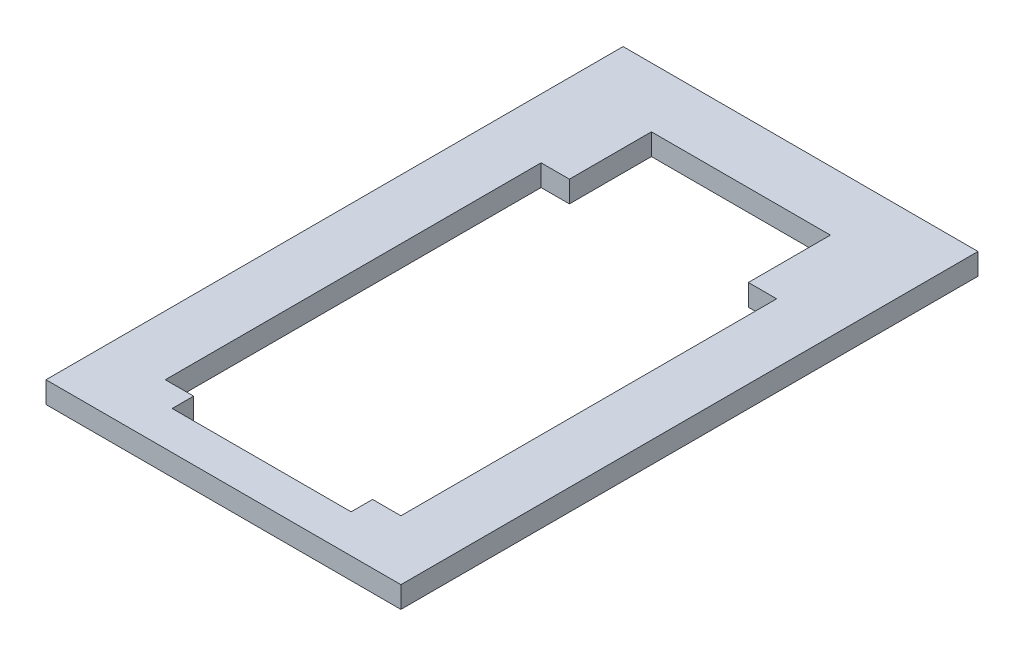
ISO-10303-21;
HEADER;
FILE_DESCRIPTION(('STEP AP214'),'2;1');
FILE_NAME('part.step','',(''),(''),'','','');
FILE_SCHEMA(('AUTOMOTIVE_DESIGN { 1 0 10303 214 1 1 1 1 }'));
ENDSEC;
DATA;
#1=APPLICATION_CONTEXT('core data for automotive mechanical design processes');
#2=APPLICATION_PROTOCOL_DEFINITION('international standard','automotive_design',2000,#1);
#3=PRODUCT_CONTEXT('',#1,'mechanical');
#4=PRODUCT('Part','Part','',(#3));
#5=PRODUCT_RELATED_PRODUCT_CATEGORY('part','',(#4));
#6=PRODUCT_DEFINITION_FORMATION('','',#4);
#7=PRODUCT_DEFINITION_CONTEXT('part definition',#1,'design');
#8=PRODUCT_DEFINITION('design','',#6,#7);
#9=PRODUCT_DEFINITION_SHAPE('','',#8);
#10=(LENGTH_UNIT() NAMED_UNIT(*) SI_UNIT(.MILLI.,.METRE.));
#11=(NAMED_UNIT(*) PLANE_ANGLE_UNIT() SI_UNIT($,.RADIAN.));
#12=(NAMED_UNIT(*) SI_UNIT($,.STERADIAN.) SOLID_ANGLE_UNIT());
#13=UNCERTAINTY_MEASURE_WITH_UNIT(LENGTH_MEASURE(1.E-05),#10,'distance_accuracy_value','');
#14=(GEOMETRIC_REPRESENTATION_CONTEXT(3) GLOBAL_UNCERTAINTY_ASSIGNED_CONTEXT((#13)) GLOBAL_UNIT_ASSIGNED_CONTEXT((#10,
#11,#12)) REPRESENTATION_CONTEXT('',''));
#15=CARTESIAN_POINT('',(0.,0.,0.));
#16=DIRECTION('',(0.,0.,1.));
#17=DIRECTION('',(1.,0.,0.));
#18=AXIS2_PLACEMENT_3D('',#15,#16,#17);
#19=CARTESIAN_POINT('',(25.0825,4.572,40.005));
#20=DIRECTION('',(0.,0.,-1.));
#21=DIRECTION('',(-1.,0.,0.));
#22=AXIS2_PLACEMENT_3D('',#19,#20,#21);
#23=PLANE('',#22);
#24=DIRECTION('',(0.,1.,0.));
#25=VECTOR('',#24,1.);
#26=CARTESIAN_POINT('',(-19.05,0.,40.005));
#27=LINE('',#26,#25);
#28=CARTESIAN_POINT('',(-19.05,0.,40.005));
#29=VERTEX_POINT('',#28);
#30=CARTESIAN_POINT('',(-19.05,4.572,40.005));
#31=VERTEX_POINT('',#30);
#32=EDGE_CURVE('E207',#29,#31,#27,.T.);
#33=ORIENTED_EDGE('',*,*,#32,.F.);
#34=DIRECTION('',(1.,0.,0.));
#35=VECTOR('',#34,1.);
#36=CARTESIAN_POINT('',(25.0825,0.,40.005));
#37=LINE('',#36,#35);
#38=CARTESIAN_POINT('',(-25.0825,0.,40.005));
#39=VERTEX_POINT('',#38);
#40=EDGE_CURVE('E244',#39,#29,#37,.T.);
#41=ORIENTED_EDGE('',*,*,#40,.F.);
#42=DIRECTION('',(0.,-1.,0.));
#43=VECTOR('',#42,1.);
#44=CARTESIAN_POINT('',(-25.0825,4.572,40.005));
#45=LINE('',#44,#43);
#46=CARTESIAN_POINT('',(-25.0825,4.572,40.005));
#47=VERTEX_POINT('',#46);
#48=EDGE_CURVE('E260',#47,#39,#45,.T.);
#49=ORIENTED_EDGE('',*,*,#48,.F.);
#50=DIRECTION('',(1.,0.,0.));
#51=VECTOR('',#50,1.);
#52=CARTESIAN_POINT('',(25.0825,4.572,40.005));
#53=LINE('',#52,#51);
#54=EDGE_CURVE('E230',#47,#31,#53,.T.);
#55=ORIENTED_EDGE('',*,*,#54,.T.);
#56=EDGE_LOOP('',(#33,#41,#49,#55));
#57=FACE_BOUND('',#56,.T.);
#58=ADVANCED_FACE('F33',(#57),#23,.T.);
#59=CARTESIAN_POINT('',(25.0825,4.572,-40.005));
#60=DIRECTION('',(0.,0.,1.));
#61=DIRECTION('',(1.,0.,0.));
#62=AXIS2_PLACEMENT_3D('',#59,#60,#61);
#63=PLANE('',#62);
#64=DIRECTION('',(0.,1.,0.));
#65=VECTOR('',#64,1.);
#66=CARTESIAN_POINT('',(-19.05,0.,-40.005));
#67=LINE('',#66,#65);
#68=CARTESIAN_POINT('',(-19.05,0.,-40.005));
#69=VERTEX_POINT('',#68);
#70=CARTESIAN_POINT('',(-19.05,4.572,-40.005));
#71=VERTEX_POINT('',#70);
#72=EDGE_CURVE('E220',#69,#71,#67,.T.);
#73=ORIENTED_EDGE('',*,*,#72,.T.);
#74=DIRECTION('',(-1.,0.,0.));
#75=VECTOR('',#74,1.);
#76=CARTESIAN_POINT('',(25.0825,4.572,-40.005));
#77=LINE('',#76,#75);
#78=CARTESIAN_POINT('',(-25.0825,4.572,-40.005));
#79=VERTEX_POINT('',#78);
#80=EDGE_CURVE('E236',#71,#79,#77,.T.);
#81=ORIENTED_EDGE('',*,*,#80,.T.);
#82=DIRECTION('',(0.,-1.,0.));
#83=VECTOR('',#82,1.);
#84=CARTESIAN_POINT('',(-25.0825,4.572,-40.005));
#85=LINE('',#84,#83);
#86=CARTESIAN_POINT('',(-25.0825,0.,-40.005));
#87=VERTEX_POINT('',#86);
#88=EDGE_CURVE('E240',#79,#87,#85,.T.);
#89=ORIENTED_EDGE('',*,*,#88,.T.);
#90=DIRECTION('',(-1.,0.,0.));
#91=VECTOR('',#90,1.);
#92=CARTESIAN_POINT('',(25.0825,0.,-40.005));
#93=LINE('',#92,#91);
#94=EDGE_CURVE('E250',#69,#87,#93,.T.);
#95=ORIENTED_EDGE('',*,*,#94,.F.);
#96=EDGE_LOOP('',(#73,#81,#89,#95));
#97=FACE_BOUND('',#96,.T.);
#98=ADVANCED_FACE('F290',(#97),#63,.T.);
#99=CARTESIAN_POINT('',(0.,4.572,0.));
#100=DIRECTION('',(0.,1.,0.));
#101=DIRECTION('',(0.,0.,1.));
#102=AXIS2_PLACEMENT_3D('',#99,#100,#101);
#103=PLANE('',#102);
#104=DIRECTION('',(-1.,0.,0.));
#105=VECTOR('',#104,1.);
#106=CARTESIAN_POINT('',(0.,4.572,-70.1675));
#107=LINE('',#106,#105);
#108=CARTESIAN_POINT('',(37.7825,4.572,-70.1675));
#109=VERTEX_POINT('',#108);
#110=CARTESIAN_POINT('',(-37.7825,4.572,-70.1675));
#111=VERTEX_POINT('',#110);
#112=EDGE_CURVE('E151',#109,#111,#107,.T.);
#113=ORIENTED_EDGE('',*,*,#112,.T.);
#114=DIRECTION('',(0.,0.,1.));
#115=VECTOR('',#114,1.);
#116=CARTESIAN_POINT('',(-37.7825,4.572,-52.705));
#117=LINE('',#116,#115);
#118=CARTESIAN_POINT('',(-37.7825,4.572,52.705));
#119=VERTEX_POINT('',#118);
#120=EDGE_CURVE('E157',#111,#119,#117,.T.);
#121=ORIENTED_EDGE('',*,*,#120,.T.);
#122=DIRECTION('',(1.,0.,0.));
#123=VECTOR('',#122,1.);
#124=CARTESIAN_POINT('',(-37.7825,4.572,52.705));
#125=LINE('',#124,#123);
#126=CARTESIAN_POINT('',(37.7825,4.572,52.705));
#127=VERTEX_POINT('',#126);
#128=EDGE_CURVE('E153',#119,#127,#125,.T.);
#129=ORIENTED_EDGE('',*,*,#128,.T.);
#130=DIRECTION('',(0.,0.,-1.));
#131=VECTOR('',#130,1.);
#132=CARTESIAN_POINT('',(37.7825,4.572,-52.705));
#133=LINE('',#132,#131);
#134=EDGE_CURVE('E146',#127,#109,#133,.T.);
#135=ORIENTED_EDGE('',*,*,#134,.T.);
#136=EDGE_LOOP('',(#113,#121,#129,#135));
#137=FACE_BOUND('',#136,.T.);
#138=DIRECTION('',(0.,0.,1.));
#139=VECTOR('',#138,1.);
#140=CARTESIAN_POINT('',(-19.05,4.572,-40.005));
#141=LINE('',#140,#139);
#142=CARTESIAN_POINT('',(-19.05,4.572,-57.4675));
#143=VERTEX_POINT('',#142);
#144=EDGE_CURVE('E188',#143,#71,#141,.T.);
#145=ORIENTED_EDGE('',*,*,#144,.F.);
#146=DIRECTION('',(-1.,0.,0.));
#147=VECTOR('',#146,1.);
#148=CARTESIAN_POINT('',(0.,4.572,-57.4675));
#149=LINE('',#148,#147);
#150=CARTESIAN_POINT('',(19.05,4.572,-57.4675));
#151=VERTEX_POINT('',#150);
#152=EDGE_CURVE('E168',#151,#143,#149,.T.);
#153=ORIENTED_EDGE('',*,*,#152,.F.);
#154=DIRECTION('',(0.,0.,-1.));
#155=VECTOR('',#154,1.);
#156=CARTESIAN_POINT('',(19.05,4.572,-40.005));
#157=LINE('',#156,#155);
#158=CARTESIAN_POINT('',(19.05,4.572,-40.005));
#159=VERTEX_POINT('',#158);
#160=EDGE_CURVE('E218',#159,#151,#157,.T.);
#161=ORIENTED_EDGE('',*,*,#160,.F.);
#162=CARTESIAN_POINT('',(25.0825,4.572,-40.005));
#163=VERTEX_POINT('',#162);
#164=EDGE_CURVE('E237',#163,#159,#77,.T.);
#165=ORIENTED_EDGE('',*,*,#164,.F.);
#166=DIRECTION('',(0.,0.,-1.));
#167=VECTOR('',#166,1.);
#168=CARTESIAN_POINT('',(25.0825,4.572,40.005));
#169=LINE('',#168,#167);
#170=CARTESIAN_POINT('',(25.0825,4.572,40.005));
#171=VERTEX_POINT('',#170);
#172=EDGE_CURVE('E233',#171,#163,#169,.T.);
#173=ORIENTED_EDGE('',*,*,#172,.F.);
#174=CARTESIAN_POINT('',(19.05,4.572,40.005));
#175=VERTEX_POINT('',#174);
#176=EDGE_CURVE('E228',#175,#171,#53,.T.);
#177=ORIENTED_EDGE('',*,*,#176,.F.);
#178=DIRECTION('',(0.,0.,-1.));
#179=VECTOR('',#178,1.);
#180=CARTESIAN_POINT('',(19.05,4.572,40.005));
#181=LINE('',#180,#179);
#182=CARTESIAN_POINT('',(19.05,4.572,44.577));
#183=VERTEX_POINT('',#182);
#184=EDGE_CURVE('E48',#183,#175,#181,.T.);
#185=ORIENTED_EDGE('',*,*,#184,.F.);
#186=DIRECTION('',(1.,0.,0.));
#187=VECTOR('',#186,1.);
#188=CARTESIAN_POINT('',(-19.05,4.572,44.577));
#189=LINE('',#188,#187);
#190=CARTESIAN_POINT('',(-19.05,4.572,44.577));
#191=VERTEX_POINT('',#190);
#192=EDGE_CURVE('E202',#191,#183,#189,.T.);
#193=ORIENTED_EDGE('',*,*,#192,.F.);
#194=DIRECTION('',(0.,0.,1.));
#195=VECTOR('',#194,1.);
#196=CARTESIAN_POINT('',(-19.05,4.572,40.005));
#197=LINE('',#196,#195);
#198=EDGE_CURVE('E199',#31,#191,#197,.T.);
#199=ORIENTED_EDGE('',*,*,#198,.F.);
#200=ORIENTED_EDGE('',*,*,#54,.F.);
#201=DIRECTION('',(0.,0.,1.));
#202=VECTOR('',#201,1.);
#203=CARTESIAN_POINT('',(-25.0825,4.572,40.005));
#204=LINE('',#203,#202);
#205=EDGE_CURVE('E226',#79,#47,#204,.T.);
#206=ORIENTED_EDGE('',*,*,#205,.F.);
#207=ORIENTED_EDGE('',*,*,#80,.F.);
#208=EDGE_LOOP('',(#145,#153,#161,#165,#173,#177,#185,#193,#199,#200,#206,#207));
#209=FACE_BOUND('',#208,.T.);
#210=ADVANCED_FACE('F148',(#137,#209),#103,.T.);
#211=CARTESIAN_POINT('',(0.,0.,0.));
#212=DIRECTION('',(0.,1.,0.));
#213=DIRECTION('',(0.,0.,1.));
#214=AXIS2_PLACEMENT_3D('',#211,#212,#213);
#215=PLANE('',#214);
#216=DIRECTION('',(0.,0.,1.));
#217=VECTOR('',#216,1.);
#218=CARTESIAN_POINT('',(-37.7825,0.,-52.705));
#219=LINE('',#218,#217);
#220=CARTESIAN_POINT('',(-37.7825,0.,-70.1675));
#221=VERTEX_POINT('',#220);
#222=CARTESIAN_POINT('',(-37.7825,0.,52.705));
#223=VERTEX_POINT('',#222);
#224=EDGE_CURVE('E266',#221,#223,#219,.T.);
#225=ORIENTED_EDGE('',*,*,#224,.F.);
#226=DIRECTION('',(1.,0.,0.));
#227=VECTOR('',#226,1.);
#228=CARTESIAN_POINT('',(0.,0.,-70.1675));
#229=LINE('',#228,#227);
#230=CARTESIAN_POINT('',(37.7825,0.,-70.1675));
#231=VERTEX_POINT('',#230);
#232=EDGE_CURVE('E186',#221,#231,#229,.T.);
#233=ORIENTED_EDGE('',*,*,#232,.T.);
#234=DIRECTION('',(0.,0.,-1.));
#235=VECTOR('',#234,1.);
#236=CARTESIAN_POINT('',(37.7825,0.,-52.705));
#237=LINE('',#236,#235);
#238=CARTESIAN_POINT('',(37.7825,0.,52.705));
#239=VERTEX_POINT('',#238);
#240=EDGE_CURVE('E163',#239,#231,#237,.T.);
#241=ORIENTED_EDGE('',*,*,#240,.F.);
#242=DIRECTION('',(1.,0.,0.));
#243=VECTOR('',#242,1.);
#244=CARTESIAN_POINT('',(-37.7825,0.,52.705));
#245=LINE('',#244,#243);
#246=EDGE_CURVE('E158',#223,#239,#245,.T.);
#247=ORIENTED_EDGE('',*,*,#246,.F.);
#248=EDGE_LOOP('',(#225,#233,#241,#247));
#249=FACE_BOUND('',#248,.T.);
#250=DIRECTION('',(1.,0.,0.));
#251=VECTOR('',#250,1.);
#252=CARTESIAN_POINT('',(0.,0.,-57.4675));
#253=LINE('',#252,#251);
#254=CARTESIAN_POINT('',(-19.05,0.,-57.4675));
#255=VERTEX_POINT('',#254);
#256=CARTESIAN_POINT('',(19.05,0.,-57.4675));
#257=VERTEX_POINT('',#256);
#258=EDGE_CURVE('E177',#255,#257,#253,.T.);
#259=ORIENTED_EDGE('',*,*,#258,.F.);
#260=DIRECTION('',(0.,0.,1.));
#261=VECTOR('',#260,1.);
#262=CARTESIAN_POINT('',(-19.05,0.,-40.005));
#263=LINE('',#262,#261);
#264=EDGE_CURVE('E215',#255,#69,#263,.T.);
#265=ORIENTED_EDGE('',*,*,#264,.T.);
#266=ORIENTED_EDGE('',*,*,#94,.T.);
#267=DIRECTION('',(0.,0.,1.));
#268=VECTOR('',#267,1.);
#269=CARTESIAN_POINT('',(-25.0825,0.,40.005));
#270=LINE('',#269,#268);
#271=EDGE_CURVE('E209',#87,#39,#270,.T.);
#272=ORIENTED_EDGE('',*,*,#271,.T.);
#273=ORIENTED_EDGE('',*,*,#40,.T.);
#274=DIRECTION('',(0.,0.,1.));
#275=VECTOR('',#274,1.);
#276=CARTESIAN_POINT('',(-19.05,0.,40.005));
#277=LINE('',#276,#275);
#278=CARTESIAN_POINT('',(-19.05,0.,44.577));
#279=VERTEX_POINT('',#278);
#280=EDGE_CURVE('E189',#29,#279,#277,.T.);
#281=ORIENTED_EDGE('',*,*,#280,.T.);
#282=DIRECTION('',(1.,0.,0.));
#283=VECTOR('',#282,1.);
#284=CARTESIAN_POINT('',(-19.05,0.,44.577));
#285=LINE('',#284,#283);
#286=CARTESIAN_POINT('',(19.05,0.,44.577));
#287=VERTEX_POINT('',#286);
#288=EDGE_CURVE('E192',#279,#287,#285,.T.);
#289=ORIENTED_EDGE('',*,*,#288,.T.);
#290=DIRECTION('',(0.,0.,-1.));
#291=VECTOR('',#290,1.);
#292=CARTESIAN_POINT('',(19.05,0.,40.005));
#293=LINE('',#292,#291);
#294=CARTESIAN_POINT('',(19.05,0.,40.005));
#295=VERTEX_POINT('',#294);
#296=EDGE_CURVE('E195',#287,#295,#293,.T.);
#297=ORIENTED_EDGE('',*,*,#296,.T.);
#298=CARTESIAN_POINT('',(25.0825,0.,40.005));
#299=VERTEX_POINT('',#298);
#300=EDGE_CURVE('E243',#295,#299,#37,.T.);
#301=ORIENTED_EDGE('',*,*,#300,.T.);
#302=DIRECTION('',(0.,0.,-1.));
#303=VECTOR('',#302,1.);
#304=CARTESIAN_POINT('',(25.0825,0.,40.005));
#305=LINE('',#304,#303);
#306=CARTESIAN_POINT('',(25.0825,0.,-40.005));
#307=VERTEX_POINT('',#306);
#308=EDGE_CURVE('E247',#299,#307,#305,.T.);
#309=ORIENTED_EDGE('',*,*,#308,.T.);
#310=CARTESIAN_POINT('',(19.05,0.,-40.005));
#311=VERTEX_POINT('',#310);
#312=EDGE_CURVE('E229',#307,#311,#93,.T.);
#313=ORIENTED_EDGE('',*,*,#312,.T.);
#314=DIRECTION('',(0.,0.,-1.));
#315=VECTOR('',#314,1.);
#316=CARTESIAN_POINT('',(19.05,0.,-40.005));
#317=LINE('',#316,#315);
#318=EDGE_CURVE('E56',#311,#257,#317,.T.);
#319=ORIENTED_EDGE('',*,*,#318,.T.);
#320=EDGE_LOOP('',(#259,#265,#266,#272,#273,#281,#289,#297,#301,#309,#313,#319));
#321=FACE_BOUND('',#320,.T.);
#322=ADVANCED_FACE('F271',(#249,#321),#215,.F.);
#323=CARTESIAN_POINT('',(37.7825,4.572,-52.705));
#324=DIRECTION('',(-1.,0.,0.));
#325=DIRECTION('',(0.,0.,1.));
#326=AXIS2_PLACEMENT_3D('',#323,#324,#325);
#327=PLANE('',#326);
#328=ORIENTED_EDGE('',*,*,#240,.T.);
#329=DIRECTION('',(0.,1.,0.));
#330=VECTOR('',#329,1.);
#331=CARTESIAN_POINT('',(37.7825,-77.5564834894544,-70.1675));
#332=LINE('',#331,#330);
#333=EDGE_CURVE('E161',#231,#109,#332,.T.);
#334=ORIENTED_EDGE('',*,*,#333,.T.);
#335=ORIENTED_EDGE('',*,*,#134,.F.);
#336=DIRECTION('',(0.,-1.,0.));
#337=VECTOR('',#336,1.);
#338=CARTESIAN_POINT('',(37.7825,4.572,52.705));
#339=LINE('',#338,#337);
#340=EDGE_CURVE('E41',#127,#239,#339,.T.);
#341=ORIENTED_EDGE('',*,*,#340,.T.);
#342=EDGE_LOOP('',(#328,#334,#335,#341));
#343=FACE_BOUND('',#342,.T.);
#344=ADVANCED_FACE('F35',(#343),#327,.F.);
#345=CARTESIAN_POINT('',(-37.7825,4.572,-52.705));
#346=DIRECTION('',(1.,0.,0.));
#347=DIRECTION('',(0.,0.,-1.));
#348=AXIS2_PLACEMENT_3D('',#345,#346,#347);
#349=PLANE('',#348);
#350=ORIENTED_EDGE('',*,*,#224,.T.);
#351=DIRECTION('',(0.,-1.,0.));
#352=VECTOR('',#351,1.);
#353=CARTESIAN_POINT('',(-37.7825,4.572,52.705));
#354=LINE('',#353,#352);
#355=EDGE_CURVE('E11',#119,#223,#354,.T.);
#356=ORIENTED_EDGE('',*,*,#355,.F.);
#357=ORIENTED_EDGE('',*,*,#120,.F.);
#358=DIRECTION('',(0.,1.,0.));
#359=VECTOR('',#358,1.);
#360=CARTESIAN_POINT('',(-37.7825,-77.5564834894544,-70.1675));
#361=LINE('',#360,#359);
#362=EDGE_CURVE('E167',#221,#111,#361,.T.);
#363=ORIENTED_EDGE('',*,*,#362,.F.);
#364=EDGE_LOOP('',(#350,#356,#357,#363));
#365=FACE_BOUND('',#364,.T.);
#366=ADVANCED_FACE('F275',(#365),#349,.F.);
#367=CARTESIAN_POINT('',(-37.7825,4.572,52.705));
#368=DIRECTION('',(0.,0.,-1.));
#369=DIRECTION('',(-1.,0.,0.));
#370=AXIS2_PLACEMENT_3D('',#367,#368,#369);
#371=PLANE('',#370);
#372=ORIENTED_EDGE('',*,*,#246,.T.);
#373=ORIENTED_EDGE('',*,*,#340,.F.);
#374=ORIENTED_EDGE('',*,*,#128,.F.);
#375=ORIENTED_EDGE('',*,*,#355,.T.);
#376=EDGE_LOOP('',(#372,#373,#374,#375));
#377=FACE_BOUND('',#376,.T.);
#378=ADVANCED_FACE('F276',(#377),#371,.F.);
#379=CARTESIAN_POINT('',(-25.0825,4.572,40.005));
#380=DIRECTION('',(1.,0.,0.));
#381=DIRECTION('',(0.,0.,-1.));
#382=AXIS2_PLACEMENT_3D('',#379,#380,#381);
#383=PLANE('',#382);
#384=ORIENTED_EDGE('',*,*,#271,.F.);
#385=ORIENTED_EDGE('',*,*,#88,.F.);
#386=ORIENTED_EDGE('',*,*,#205,.T.);
#387=ORIENTED_EDGE('',*,*,#48,.T.);
#388=EDGE_LOOP('',(#384,#385,#386,#387));
#389=FACE_BOUND('',#388,.T.);
#390=ADVANCED_FACE('F278',(#389),#383,.T.);
#391=DIRECTION('',(0.,1.,0.));
#392=VECTOR('',#391,1.);
#393=CARTESIAN_POINT('',(19.05,0.,40.005));
#394=LINE('',#393,#392);
#395=EDGE_CURVE('E210',#295,#175,#394,.T.);
#396=ORIENTED_EDGE('',*,*,#395,.T.);
#397=ORIENTED_EDGE('',*,*,#176,.T.);
#398=DIRECTION('',(0.,-1.,0.));
#399=VECTOR('',#398,1.);
#400=CARTESIAN_POINT('',(25.0825,4.572,40.005));
#401=LINE('',#400,#399);
#402=EDGE_CURVE('E257',#171,#299,#401,.T.);
#403=ORIENTED_EDGE('',*,*,#402,.T.);
#404=ORIENTED_EDGE('',*,*,#300,.F.);
#405=EDGE_LOOP('',(#396,#397,#403,#404));
#406=FACE_BOUND('',#405,.T.);
#407=ADVANCED_FACE('F284',(#406),#23,.T.);
#408=CARTESIAN_POINT('',(25.0825,4.572,40.005));
#409=DIRECTION('',(-1.,0.,0.));
#410=DIRECTION('',(0.,0.,1.));
#411=AXIS2_PLACEMENT_3D('',#408,#409,#410);
#412=PLANE('',#411);
#413=ORIENTED_EDGE('',*,*,#308,.F.);
#414=ORIENTED_EDGE('',*,*,#402,.F.);
#415=ORIENTED_EDGE('',*,*,#172,.T.);
#416=DIRECTION('',(0.,-1.,0.));
#417=VECTOR('',#416,1.);
#418=CARTESIAN_POINT('',(25.0825,4.572,-40.005));
#419=LINE('',#418,#417);
#420=EDGE_CURVE('E255',#163,#307,#419,.T.);
#421=ORIENTED_EDGE('',*,*,#420,.T.);
#422=EDGE_LOOP('',(#413,#414,#415,#421));
#423=FACE_BOUND('',#422,.T.);
#424=ADVANCED_FACE('F301',(#423),#412,.T.);
#425=DIRECTION('',(0.,1.,0.));
#426=VECTOR('',#425,1.);
#427=CARTESIAN_POINT('',(19.05,0.,-40.005));
#428=LINE('',#427,#426);
#429=EDGE_CURVE('E203',#311,#159,#428,.T.);
#430=ORIENTED_EDGE('',*,*,#429,.F.);
#431=ORIENTED_EDGE('',*,*,#312,.F.);
#432=ORIENTED_EDGE('',*,*,#420,.F.);
#433=ORIENTED_EDGE('',*,*,#164,.T.);
#434=EDGE_LOOP('',(#430,#431,#432,#433));
#435=FACE_BOUND('',#434,.T.);
#436=ADVANCED_FACE('F297',(#435),#63,.T.);
#437=CARTESIAN_POINT('',(-19.05,0.,-40.005));
#438=DIRECTION('',(-1.,0.,0.));
#439=DIRECTION('',(0.,0.,1.));
#440=AXIS2_PLACEMENT_3D('',#437,#438,#439);
#441=PLANE('',#440);
#442=ORIENTED_EDGE('',*,*,#144,.T.);
#443=ORIENTED_EDGE('',*,*,#72,.F.);
#444=ORIENTED_EDGE('',*,*,#264,.F.);
#445=DIRECTION('',(0.,1.,0.));
#446=VECTOR('',#445,1.);
#447=CARTESIAN_POINT('',(-19.05,-77.5564834894544,-57.4675));
#448=LINE('',#447,#446);
#449=EDGE_CURVE('E182',#255,#143,#448,.T.);
#450=ORIENTED_EDGE('',*,*,#449,.T.);
#451=EDGE_LOOP('',(#442,#443,#444,#450));
#452=FACE_BOUND('',#451,.T.);
#453=ADVANCED_FACE('F334',(#452),#441,.F.);
#454=CARTESIAN_POINT('',(19.05,0.,-40.005));
#455=DIRECTION('',(1.,0.,0.));
#456=DIRECTION('',(0.,0.,-1.));
#457=AXIS2_PLACEMENT_3D('',#454,#455,#456);
#458=PLANE('',#457);
#459=ORIENTED_EDGE('',*,*,#160,.T.);
#460=DIRECTION('',(0.,1.,0.));
#461=VECTOR('',#460,1.);
#462=CARTESIAN_POINT('',(19.05,-77.5564834894544,-57.4675));
#463=LINE('',#462,#461);
#464=EDGE_CURVE('E179',#257,#151,#463,.T.);
#465=ORIENTED_EDGE('',*,*,#464,.F.);
#466=ORIENTED_EDGE('',*,*,#318,.F.);
#467=ORIENTED_EDGE('',*,*,#429,.T.);
#468=EDGE_LOOP('',(#459,#465,#466,#467));
#469=FACE_BOUND('',#468,.T.);
#470=ADVANCED_FACE('F338',(#469),#458,.F.);
#471=CARTESIAN_POINT('',(-19.05,0.,40.005));
#472=DIRECTION('',(-1.,0.,0.));
#473=DIRECTION('',(0.,0.,1.));
#474=AXIS2_PLACEMENT_3D('',#471,#472,#473);
#475=PLANE('',#474);
#476=ORIENTED_EDGE('',*,*,#198,.T.);
#477=DIRECTION('',(0.,1.,0.));
#478=VECTOR('',#477,1.);
#479=CARTESIAN_POINT('',(-19.05,0.,44.577));
#480=LINE('',#479,#478);
#481=EDGE_CURVE('E198',#279,#191,#480,.T.);
#482=ORIENTED_EDGE('',*,*,#481,.F.);
#483=ORIENTED_EDGE('',*,*,#280,.F.);
#484=ORIENTED_EDGE('',*,*,#32,.T.);
#485=EDGE_LOOP('',(#476,#482,#483,#484));
#486=FACE_BOUND('',#485,.T.);
#487=ADVANCED_FACE('F349',(#486),#475,.F.);
#488=CARTESIAN_POINT('',(19.05,0.,40.005));
#489=DIRECTION('',(1.,0.,0.));
#490=DIRECTION('',(0.,0.,-1.));
#491=AXIS2_PLACEMENT_3D('',#488,#489,#490);
#492=PLANE('',#491);
#493=ORIENTED_EDGE('',*,*,#184,.T.);
#494=ORIENTED_EDGE('',*,*,#395,.F.);
#495=ORIENTED_EDGE('',*,*,#296,.F.);
#496=DIRECTION('',(0.,1.,0.));
#497=VECTOR('',#496,1.);
#498=CARTESIAN_POINT('',(19.05,0.,44.577));
#499=LINE('',#498,#497);
#500=EDGE_CURVE('E212',#287,#183,#499,.T.);
#501=ORIENTED_EDGE('',*,*,#500,.T.);
#502=EDGE_LOOP('',(#493,#494,#495,#501));
#503=FACE_BOUND('',#502,.T.);
#504=ADVANCED_FACE('F319',(#503),#492,.F.);
#505=CARTESIAN_POINT('',(-19.05,0.,44.577));
#506=DIRECTION('',(0.,0.,1.));
#507=DIRECTION('',(1.,0.,0.));
#508=AXIS2_PLACEMENT_3D('',#505,#506,#507);
#509=PLANE('',#508);
#510=ORIENTED_EDGE('',*,*,#192,.T.);
#511=ORIENTED_EDGE('',*,*,#500,.F.);
#512=ORIENTED_EDGE('',*,*,#288,.F.);
#513=ORIENTED_EDGE('',*,*,#481,.T.);
#514=EDGE_LOOP('',(#510,#511,#512,#513));
#515=FACE_BOUND('',#514,.T.);
#516=ADVANCED_FACE('F321',(#515),#509,.F.);
#517=CARTESIAN_POINT('',(0.,-77.5564834894544,-57.4675));
#518=DIRECTION('',(0.,0.,-1.));
#519=DIRECTION('',(-1.,0.,0.));
#520=AXIS2_PLACEMENT_3D('',#517,#518,#519);
#521=PLANE('',#520);
#522=ORIENTED_EDGE('',*,*,#449,.F.);
#523=ORIENTED_EDGE('',*,*,#258,.T.);
#524=ORIENTED_EDGE('',*,*,#464,.T.);
#525=ORIENTED_EDGE('',*,*,#152,.T.);
#526=EDGE_LOOP('',(#522,#523,#524,#525));
#527=FACE_BOUND('',#526,.T.);
#528=ADVANCED_FACE('F337',(#527),#521,.F.);
#529=CARTESIAN_POINT('',(0.,-77.5564834894544,-70.1675));
#530=DIRECTION('',(0.,0.,-1.));
#531=DIRECTION('',(-1.,0.,0.));
#532=AXIS2_PLACEMENT_3D('',#529,#530,#531);
#533=PLANE('',#532);
#534=ORIENTED_EDGE('',*,*,#232,.F.);
#535=ORIENTED_EDGE('',*,*,#362,.T.);
#536=ORIENTED_EDGE('',*,*,#112,.F.);
#537=ORIENTED_EDGE('',*,*,#333,.F.);
#538=EDGE_LOOP('',(#534,#535,#536,#537));
#539=FACE_BOUND('',#538,.T.);
#540=ADVANCED_FACE('F171',(#539),#533,.T.);
#541=CLOSED_SHELL('',(#58,#98,#210,#322,#344,#366,#378,#390,#407,#424,#436,#453,#470,#487,#504,
#516,#528,#540));
#542=MANIFOLD_SOLID_BREP('B2',#541);
#543=ADVANCED_BREP_SHAPE_REPRESENTATION('',(#18,#542),#14);
#544=SHAPE_DEFINITION_REPRESENTATION(#9,#543);
ENDSEC;
END-ISO-10303-21;
